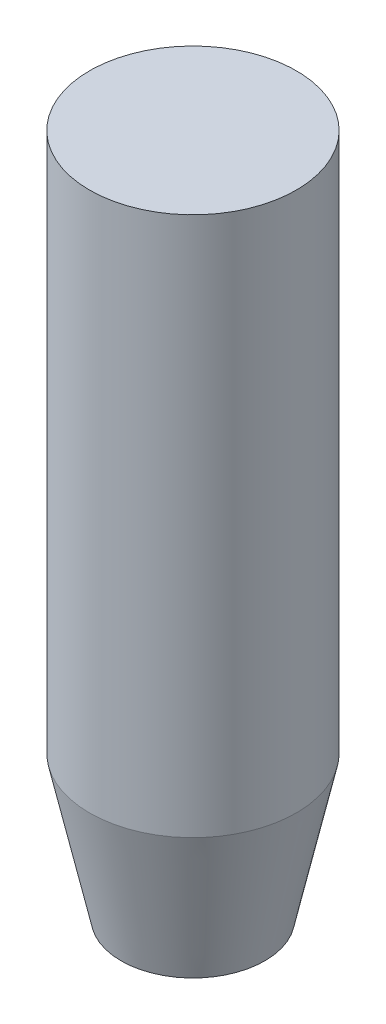
ISO-10303-21;
HEADER;
FILE_DESCRIPTION(('STEP AP214'),'2;1');
FILE_NAME('part.step','',(''),(''),'','','');
FILE_SCHEMA(('AUTOMOTIVE_DESIGN { 1 0 10303 214 1 1 1 1 }'));
ENDSEC;
DATA;
#1=APPLICATION_CONTEXT('core data for automotive mechanical design processes');
#2=APPLICATION_PROTOCOL_DEFINITION('international standard','automotive_design',2000,#1);
#3=PRODUCT_CONTEXT('',#1,'mechanical');
#4=PRODUCT('Part','Part','',(#3));
#5=PRODUCT_RELATED_PRODUCT_CATEGORY('part','',(#4));
#6=PRODUCT_DEFINITION_FORMATION('','',#4);
#7=PRODUCT_DEFINITION_CONTEXT('part definition',#1,'design');
#8=PRODUCT_DEFINITION('design','',#6,#7);
#9=PRODUCT_DEFINITION_SHAPE('','',#8);
#10=(LENGTH_UNIT() NAMED_UNIT(*) SI_UNIT(.MILLI.,.METRE.));
#11=(NAMED_UNIT(*) PLANE_ANGLE_UNIT() SI_UNIT($,.RADIAN.));
#12=(NAMED_UNIT(*) SI_UNIT($,.STERADIAN.) SOLID_ANGLE_UNIT());
#13=UNCERTAINTY_MEASURE_WITH_UNIT(LENGTH_MEASURE(1.E-05),#10,'distance_accuracy_value','');
#14=(GEOMETRIC_REPRESENTATION_CONTEXT(3) GLOBAL_UNCERTAINTY_ASSIGNED_CONTEXT((#13)) GLOBAL_UNIT_ASSIGNED_CONTEXT((#10,
#11,#12)) REPRESENTATION_CONTEXT('',''));
#15=CARTESIAN_POINT('',(0.,0.,0.));
#16=DIRECTION('',(0.,0.,1.));
#17=DIRECTION('',(1.,0.,0.));
#18=AXIS2_PLACEMENT_3D('',#15,#16,#17);
#19=CARTESIAN_POINT('',(0.,120.65,0.));
#20=DIRECTION('',(0.,-1.,0.));
#21=DIRECTION('',(0.,0.,-1.));
#22=AXIS2_PLACEMENT_3D('',#19,#20,#21);
#23=CYLINDRICAL_SURFACE('',#22,18.25625);
#24=CARTESIAN_POINT('',(0.,25.4000000000012,0.));
#25=DIRECTION('',(0.,1.,0.));
#26=DIRECTION('',(0.,0.,1.));
#27=AXIS2_PLACEMENT_3D('',#24,#25,#26);
#28=CIRCLE('',#27,18.25625);
#29=CARTESIAN_POINT('',(0.,25.4000000000012,18.25625));
#30=VERTEX_POINT('',#29);
#31=EDGE_CURVE('E42',#30,#30,#28,.T.);
#32=ORIENTED_EDGE('',*,*,#31,.T.);
#33=EDGE_LOOP('',(#32));
#34=FACE_BOUND('',#33,.T.);
#35=CARTESIAN_POINT('',(0.,120.65,0.));
#36=DIRECTION('',(0.,1.,0.));
#37=DIRECTION('',(0.,0.,1.));
#38=AXIS2_PLACEMENT_3D('',#35,#36,#37);
#39=CIRCLE('',#38,18.25625);
#40=CARTESIAN_POINT('',(0.,120.65,18.25625));
#41=VERTEX_POINT('',#40);
#42=EDGE_CURVE('E46',#41,#41,#39,.T.);
#43=ORIENTED_EDGE('',*,*,#42,.F.);
#44=EDGE_LOOP('',(#43));
#45=FACE_BOUND('',#44,.T.);
#46=ADVANCED_FACE('F35',(#34,#45),#23,.T.);
#47=CARTESIAN_POINT('',(0.,120.65,0.));
#48=DIRECTION('',(0.,1.,0.));
#49=DIRECTION('',(0.,0.,1.));
#50=AXIS2_PLACEMENT_3D('',#47,#48,#49);
#51=PLANE('',#50);
#52=ORIENTED_EDGE('',*,*,#42,.T.);
#53=EDGE_LOOP('',(#52));
#54=FACE_BOUND('',#53,.T.);
#55=ADVANCED_FACE('F53',(#54),#51,.T.);
#56=CARTESIAN_POINT('',(0.,0.,0.));
#57=DIRECTION('',(0.,1.,0.));
#58=DIRECTION('',(0.,0.,1.));
#59=AXIS2_PLACEMENT_3D('',#56,#57,#58);
#60=PLANE('',#59);
#61=CARTESIAN_POINT('',(0.,0.,0.));
#62=DIRECTION('',(0.,1.,0.));
#63=DIRECTION('',(0.,0.,1.));
#64=AXIS2_PLACEMENT_3D('',#61,#62,#63);
#65=CIRCLE('',#64,12.6999999999998);
#66=CARTESIAN_POINT('',(0.,0.,12.6999999999998));
#67=VERTEX_POINT('',#66);
#68=EDGE_CURVE('E10',#67,#67,#65,.F.);
#69=ORIENTED_EDGE('',*,*,#68,.T.);
#70=EDGE_LOOP('',(#69));
#71=FACE_BOUND('',#70,.T.);
#72=ADVANCED_FACE('F60',(#71),#60,.F.);
#73=CARTESIAN_POINT('',(0.,25.4000000000012,0.));
#74=DIRECTION('',(0.,1.,0.));
#75=DIRECTION('',(0.,0.,1.));
#76=AXIS2_PLACEMENT_3D('',#73,#74,#75);
#77=CONICAL_SURFACE('',#76,18.25625,0.215357699697737);
#78=ORIENTED_EDGE('',*,*,#68,.F.);
#79=EDGE_LOOP('',(#78));
#80=FACE_BOUND('',#79,.T.);
#81=ORIENTED_EDGE('',*,*,#31,.F.);
#82=EDGE_LOOP('',(#81));
#83=FACE_BOUND('',#82,.T.);
#84=ADVANCED_FACE('F37',(#80,#83),#77,.T.);
#85=CLOSED_SHELL('',(#46,#55,#72,#84));
#86=MANIFOLD_SOLID_BREP('B2',#85);
#87=ADVANCED_BREP_SHAPE_REPRESENTATION('',(#18,#86),#14);
#88=SHAPE_DEFINITION_REPRESENTATION(#9,#87);
ENDSEC;
END-ISO-10303-21;
